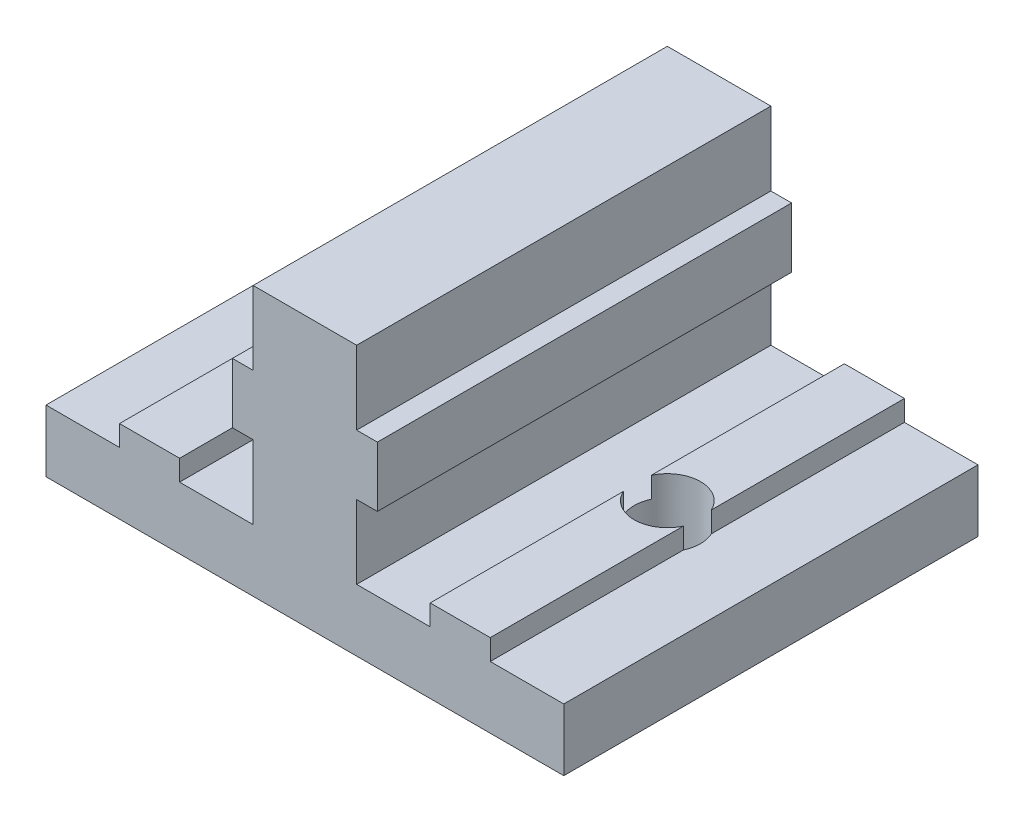
ISO-10303-21;
HEADER;
FILE_DESCRIPTION(('STEP AP214'),'2;1');
FILE_NAME('part.step','',(''),(''),'','','');
FILE_SCHEMA(('AUTOMOTIVE_DESIGN { 1 0 10303 214 1 1 1 1 }'));
ENDSEC;
DATA;
#1=APPLICATION_CONTEXT('core data for automotive mechanical design processes');
#2=APPLICATION_PROTOCOL_DEFINITION('international standard','automotive_design',2000,#1);
#3=PRODUCT_CONTEXT('',#1,'mechanical');
#4=PRODUCT('Part','Part','',(#3));
#5=PRODUCT_RELATED_PRODUCT_CATEGORY('part','',(#4));
#6=PRODUCT_DEFINITION_FORMATION('','',#4);
#7=PRODUCT_DEFINITION_CONTEXT('part definition',#1,'design');
#8=PRODUCT_DEFINITION('design','',#6,#7);
#9=PRODUCT_DEFINITION_SHAPE('','',#8);
#10=(LENGTH_UNIT() NAMED_UNIT(*) SI_UNIT(.MILLI.,.METRE.));
#11=(NAMED_UNIT(*) PLANE_ANGLE_UNIT() SI_UNIT($,.RADIAN.));
#12=(NAMED_UNIT(*) SI_UNIT($,.STERADIAN.) SOLID_ANGLE_UNIT());
#13=UNCERTAINTY_MEASURE_WITH_UNIT(LENGTH_MEASURE(1.E-05),#10,'distance_accuracy_value','');
#14=(GEOMETRIC_REPRESENTATION_CONTEXT(3) GLOBAL_UNCERTAINTY_ASSIGNED_CONTEXT((#13)) GLOBAL_UNIT_ASSIGNED_CONTEXT((#10,
#11,#12)) REPRESENTATION_CONTEXT('',''));
#15=CARTESIAN_POINT('',(0.,0.,0.));
#16=DIRECTION('',(0.,0.,1.));
#17=DIRECTION('',(1.,0.,0.));
#18=AXIS2_PLACEMENT_3D('',#15,#16,#17);
#19=CARTESIAN_POINT('',(8.95,3.,20.));
#20=DIRECTION('',(1.,0.,0.));
#21=DIRECTION('',(0.,0.,-1.));
#22=AXIS2_PLACEMENT_3D('',#19,#20,#21);
#23=PLANE('',#22);
#24=DIRECTION('',(0.,-1.,0.));
#25=VECTOR('',#24,1.);
#26=CARTESIAN_POINT('',(8.95,13.,10.6763874629234));
#27=LINE('',#26,#25);
#28=CARTESIAN_POINT('',(8.95,4.,10.6763874629234));
#29=VERTEX_POINT('',#28);
#30=CARTESIAN_POINT('',(8.95000000000001,3.,10.6763874629234));
#31=VERTEX_POINT('',#30);
#32=EDGE_CURVE('E607',#29,#31,#27,.T.);
#33=ORIENTED_EDGE('',*,*,#32,.F.);
#34=DIRECTION('',(0.,0.,-1.));
#35=VECTOR('',#34,1.);
#36=CARTESIAN_POINT('',(8.95,4.,20.));
#37=LINE('',#36,#35);
#38=CARTESIAN_POINT('',(8.95,4.,20.));
#39=VERTEX_POINT('',#38);
#40=EDGE_CURVE('E267',#39,#29,#37,.T.);
#41=ORIENTED_EDGE('',*,*,#40,.F.);
#42=DIRECTION('',(0.,-1.,0.));
#43=VECTOR('',#42,1.);
#44=CARTESIAN_POINT('',(8.95,3.,20.));
#45=LINE('',#44,#43);
#46=CARTESIAN_POINT('',(8.95,3.,20.));
#47=VERTEX_POINT('',#46);
#48=EDGE_CURVE('E433',#39,#47,#45,.T.);
#49=ORIENTED_EDGE('',*,*,#48,.T.);
#50=DIRECTION('',(0.,0.,-1.));
#51=VECTOR('',#50,1.);
#52=CARTESIAN_POINT('',(8.95,3.,20.));
#53=LINE('',#52,#51);
#54=EDGE_CURVE('E271',#47,#31,#53,.T.);
#55=ORIENTED_EDGE('',*,*,#54,.T.);
#56=EDGE_LOOP('',(#33,#41,#49,#55));
#57=FACE_BOUND('',#56,.T.);
#58=ADVANCED_FACE('F32',(#57),#23,.T.);
#59=CARTESIAN_POINT('',(8.95,4.,20.));
#60=DIRECTION('',(0.,1.,0.));
#61=DIRECTION('',(-1.,0.,0.));
#62=AXIS2_PLACEMENT_3D('',#59,#60,#61);
#63=PLANE('',#62);
#64=CARTESIAN_POINT('',(7.5,4.,10.));
#65=DIRECTION('',(0.,1.,0.));
#66=DIRECTION('',(-1.,0.,0.));
#67=AXIS2_PLACEMENT_3D('',#64,#65,#66);
#68=CIRCLE('',#67,1.6);
#69=CARTESIAN_POINT('',(6.05,4.,10.6763874629234));
#70=VERTEX_POINT('',#69);
#71=EDGE_CURVE('E608',#70,#29,#68,.T.);
#72=ORIENTED_EDGE('',*,*,#71,.F.);
#73=DIRECTION('',(0.,0.,-1.));
#74=VECTOR('',#73,1.);
#75=CARTESIAN_POINT('',(6.05,4.,20.));
#76=LINE('',#75,#74);
#77=CARTESIAN_POINT('',(6.05,4.,20.));
#78=VERTEX_POINT('',#77);
#79=EDGE_CURVE('E251',#78,#70,#76,.T.);
#80=ORIENTED_EDGE('',*,*,#79,.F.);
#81=DIRECTION('',(1.,0.,0.));
#82=VECTOR('',#81,1.);
#83=CARTESIAN_POINT('',(8.95,4.,20.));
#84=LINE('',#83,#82);
#85=EDGE_CURVE('E436',#78,#39,#84,.T.);
#86=ORIENTED_EDGE('',*,*,#85,.T.);
#87=ORIENTED_EDGE('',*,*,#40,.T.);
#88=EDGE_LOOP('',(#72,#80,#86,#87));
#89=FACE_BOUND('',#88,.T.);
#90=ADVANCED_FACE('F577',(#89),#63,.T.);
#91=CARTESIAN_POINT('',(6.05,4.,20.));
#92=DIRECTION('',(-1.,0.,0.));
#93=DIRECTION('',(0.,-1.,0.));
#94=AXIS2_PLACEMENT_3D('',#91,#92,#93);
#95=PLANE('',#94);
#96=DIRECTION('',(0.,-1.,0.));
#97=VECTOR('',#96,1.);
#98=CARTESIAN_POINT('',(6.04999999999999,13.,9.32361253707657));
#99=LINE('',#98,#97);
#100=CARTESIAN_POINT('',(6.05,4.,9.32361253707657));
#101=VERTEX_POINT('',#100);
#102=CARTESIAN_POINT('',(6.05,3.,9.32361253707656));
#103=VERTEX_POINT('',#102);
#104=EDGE_CURVE('E46',#101,#103,#99,.T.);
#105=ORIENTED_EDGE('',*,*,#104,.F.);
#106=CARTESIAN_POINT('',(6.05,4.,0.));
#107=VERTEX_POINT('',#106);
#108=EDGE_CURVE('E258',#101,#107,#76,.T.);
#109=ORIENTED_EDGE('',*,*,#108,.T.);
#110=DIRECTION('',(0.,1.,0.));
#111=VECTOR('',#110,1.);
#112=CARTESIAN_POINT('',(6.05,4.,0.));
#113=LINE('',#112,#111);
#114=CARTESIAN_POINT('',(6.05,3.,0.));
#115=VERTEX_POINT('',#114);
#116=EDGE_CURVE('E469',#115,#107,#113,.T.);
#117=ORIENTED_EDGE('',*,*,#116,.F.);
#118=DIRECTION('',(0.,0.,-1.));
#119=VECTOR('',#118,1.);
#120=CARTESIAN_POINT('',(6.05,3.,20.));
#121=LINE('',#120,#119);
#122=EDGE_CURVE('E259',#103,#115,#121,.T.);
#123=ORIENTED_EDGE('',*,*,#122,.F.);
#124=EDGE_LOOP('',(#105,#109,#117,#123));
#125=FACE_BOUND('',#124,.T.);
#126=ADVANCED_FACE('F584',(#125),#95,.T.);
#127=CARTESIAN_POINT('',(-6.05,4.,20.));
#128=DIRECTION('',(-1.,0.,0.));
#129=DIRECTION('',(0.,-1.,0.));
#130=AXIS2_PLACEMENT_3D('',#127,#128,#129);
#131=PLANE('',#130);
#132=DIRECTION('',(0.,0.,-1.));
#133=VECTOR('',#132,1.);
#134=CARTESIAN_POINT('',(-6.05,4.,20.));
#135=LINE('',#134,#133);
#136=CARTESIAN_POINT('',(-6.05,4.,9.32361253707657));
#137=VERTEX_POINT('',#136);
#138=CARTESIAN_POINT('',(-6.05,4.,0.));
#139=VERTEX_POINT('',#138);
#140=EDGE_CURVE('E349',#137,#139,#135,.T.);
#141=ORIENTED_EDGE('',*,*,#140,.F.);
#142=DIRECTION('',(0.,-1.,0.));
#143=VECTOR('',#142,1.);
#144=CARTESIAN_POINT('',(-6.04999999999999,13.,9.32361253707659));
#145=LINE('',#144,#143);
#146=CARTESIAN_POINT('',(-6.04999999999999,3.,9.32361253707659));
#147=VERTEX_POINT('',#146);
#148=EDGE_CURVE('E419',#137,#147,#145,.T.);
#149=ORIENTED_EDGE('',*,*,#148,.T.);
#150=DIRECTION('',(0.,0.,-1.));
#151=VECTOR('',#150,1.);
#152=CARTESIAN_POINT('',(-6.05,3.,20.));
#153=LINE('',#152,#151);
#154=CARTESIAN_POINT('',(-6.05,3.,0.));
#155=VERTEX_POINT('',#154);
#156=EDGE_CURVE('E353',#147,#155,#153,.T.);
#157=ORIENTED_EDGE('',*,*,#156,.T.);
#158=DIRECTION('',(0.,1.,0.));
#159=VECTOR('',#158,1.);
#160=CARTESIAN_POINT('',(-6.05,4.,0.));
#161=LINE('',#160,#159);
#162=EDGE_CURVE('E324',#155,#139,#161,.T.);
#163=ORIENTED_EDGE('',*,*,#162,.T.);
#164=EDGE_LOOP('',(#141,#149,#157,#163));
#165=FACE_BOUND('',#164,.T.);
#166=ADVANCED_FACE('F564',(#165),#131,.F.);
#167=CARTESIAN_POINT('',(-8.95,4.,20.));
#168=DIRECTION('',(0.,-1.,0.));
#169=DIRECTION('',(1.,0.,0.));
#170=AXIS2_PLACEMENT_3D('',#167,#168,#169);
#171=PLANE('',#170);
#172=CARTESIAN_POINT('',(-6.05,4.,20.));
#173=VERTEX_POINT('',#172);
#174=CARTESIAN_POINT('',(-6.05,4.,10.6763874629234));
#175=VERTEX_POINT('',#174);
#176=EDGE_CURVE('E350',#173,#175,#135,.T.);
#177=ORIENTED_EDGE('',*,*,#176,.T.);
#178=CARTESIAN_POINT('',(-7.5,4.,10.));
#179=DIRECTION('',(0.,-1.,0.));
#180=DIRECTION('',(1.,0.,0.));
#181=AXIS2_PLACEMENT_3D('',#178,#179,#180);
#182=CIRCLE('',#181,1.6);
#183=CARTESIAN_POINT('',(-8.95,4.,10.6763874629234));
#184=VERTEX_POINT('',#183);
#185=EDGE_CURVE('E410',#175,#184,#182,.T.);
#186=ORIENTED_EDGE('',*,*,#185,.T.);
#187=DIRECTION('',(0.,0.,-1.));
#188=VECTOR('',#187,1.);
#189=CARTESIAN_POINT('',(-8.95,4.,20.));
#190=LINE('',#189,#188);
#191=CARTESIAN_POINT('',(-8.95,4.,20.));
#192=VERTEX_POINT('',#191);
#193=EDGE_CURVE('E346',#192,#184,#190,.T.);
#194=ORIENTED_EDGE('',*,*,#193,.F.);
#195=DIRECTION('',(-1.,0.,0.));
#196=VECTOR('',#195,1.);
#197=CARTESIAN_POINT('',(-8.95,4.,20.));
#198=LINE('',#197,#196);
#199=EDGE_CURVE('E299',#173,#192,#198,.T.);
#200=ORIENTED_EDGE('',*,*,#199,.F.);
#201=EDGE_LOOP('',(#177,#186,#194,#200));
#202=FACE_BOUND('',#201,.T.);
#203=ADVANCED_FACE('F559',(#202),#171,.F.);
#204=CARTESIAN_POINT('',(-8.95,3.,20.));
#205=DIRECTION('',(1.,0.,0.));
#206=DIRECTION('',(0.,0.,-1.));
#207=AXIS2_PLACEMENT_3D('',#204,#205,#206);
#208=PLANE('',#207);
#209=ORIENTED_EDGE('',*,*,#193,.T.);
#210=DIRECTION('',(0.,-1.,0.));
#211=VECTOR('',#210,1.);
#212=CARTESIAN_POINT('',(-8.95,13.,10.6763874629234));
#213=LINE('',#212,#211);
#214=CARTESIAN_POINT('',(-8.95,3.,10.6763874629234));
#215=VERTEX_POINT('',#214);
#216=EDGE_CURVE('E405',#184,#215,#213,.T.);
#217=ORIENTED_EDGE('',*,*,#216,.T.);
#218=DIRECTION('',(0.,0.,-1.));
#219=VECTOR('',#218,1.);
#220=CARTESIAN_POINT('',(-8.95,3.,20.));
#221=LINE('',#220,#219);
#222=CARTESIAN_POINT('',(-8.95,3.,20.));
#223=VERTEX_POINT('',#222);
#224=EDGE_CURVE('E342',#223,#215,#221,.T.);
#225=ORIENTED_EDGE('',*,*,#224,.F.);
#226=DIRECTION('',(0.,-1.,0.));
#227=VECTOR('',#226,1.);
#228=CARTESIAN_POINT('',(-8.95,3.,20.));
#229=LINE('',#228,#227);
#230=EDGE_CURVE('E301',#192,#223,#229,.T.);
#231=ORIENTED_EDGE('',*,*,#230,.F.);
#232=EDGE_LOOP('',(#209,#217,#225,#231));
#233=FACE_BOUND('',#232,.T.);
#234=ADVANCED_FACE('F404',(#233),#208,.F.);
#235=CARTESIAN_POINT('',(0.,0.,20.));
#236=DIRECTION('',(0.,1.,0.));
#237=DIRECTION('',(-1.,0.,0.));
#238=AXIS2_PLACEMENT_3D('',#235,#236,#237);
#239=PLANE('',#238);
#240=CARTESIAN_POINT('',(7.5,0.,10.));
#241=DIRECTION('',(0.,-1.,0.));
#242=DIRECTION('',(1.,0.,0.));
#243=AXIS2_PLACEMENT_3D('',#240,#241,#242);
#244=CIRCLE('',#243,1.6);
#245=CARTESIAN_POINT('',(9.1,0.,10.));
#246=VERTEX_POINT('',#245);
#247=EDGE_CURVE('E252',#246,#246,#244,.T.);
#248=ORIENTED_EDGE('',*,*,#247,.F.);
#249=EDGE_LOOP('',(#248));
#250=FACE_BOUND('',#249,.T.);
#251=CARTESIAN_POINT('',(-7.5,0.,10.));
#252=DIRECTION('',(0.,-1.,0.));
#253=DIRECTION('',(1.,0.,0.));
#254=AXIS2_PLACEMENT_3D('',#251,#252,#253);
#255=CIRCLE('',#254,1.6);
#256=CARTESIAN_POINT('',(-5.9,0.,10.));
#257=VERTEX_POINT('',#256);
#258=EDGE_CURVE('E412',#257,#257,#255,.T.);
#259=ORIENTED_EDGE('',*,*,#258,.F.);
#260=EDGE_LOOP('',(#259));
#261=FACE_BOUND('',#260,.T.);
#262=DIRECTION('',(1.,0.,0.));
#263=VECTOR('',#262,1.);
#264=CARTESIAN_POINT('',(0.,0.,0.));
#265=LINE('',#264,#263);
#266=CARTESIAN_POINT('',(-12.5,0.,0.));
#267=VERTEX_POINT('',#266);
#268=CARTESIAN_POINT('',(12.5,0.,0.));
#269=VERTEX_POINT('',#268);
#270=EDGE_CURVE('E279',#267,#269,#265,.T.);
#271=ORIENTED_EDGE('',*,*,#270,.T.);
#272=DIRECTION('',(0.,0.,-1.));
#273=VECTOR('',#272,1.);
#274=CARTESIAN_POINT('',(12.5,0.,20.));
#275=LINE('',#274,#273);
#276=CARTESIAN_POINT('',(12.5,0.,20.));
#277=VERTEX_POINT('',#276);
#278=EDGE_CURVE('E276',#277,#269,#275,.T.);
#279=ORIENTED_EDGE('',*,*,#278,.F.);
#280=DIRECTION('',(1.,0.,0.));
#281=VECTOR('',#280,1.);
#282=CARTESIAN_POINT('',(0.,0.,20.));
#283=LINE('',#282,#281);
#284=CARTESIAN_POINT('',(-12.5,0.,20.));
#285=VERTEX_POINT('',#284);
#286=EDGE_CURVE('E280',#285,#277,#283,.T.);
#287=ORIENTED_EDGE('',*,*,#286,.F.);
#288=DIRECTION('',(0.,0.,-1.));
#289=VECTOR('',#288,1.);
#290=CARTESIAN_POINT('',(-12.5,0.,20.));
#291=LINE('',#290,#289);
#292=EDGE_CURVE('E307',#285,#267,#291,.T.);
#293=ORIENTED_EDGE('',*,*,#292,.T.);
#294=EDGE_LOOP('',(#271,#279,#287,#293));
#295=FACE_BOUND('',#294,.T.);
#296=ADVANCED_FACE('F34',(#250,#261,#295),#239,.F.);
#297=CARTESIAN_POINT('',(-2.5,13.,20.));
#298=DIRECTION('',(0.,-1.,0.));
#299=DIRECTION('',(0.,0.,-1.));
#300=AXIS2_PLACEMENT_3D('',#297,#298,#299);
#301=PLANE('',#300);
#302=DIRECTION('',(-1.,0.,0.));
#303=VECTOR('',#302,1.);
#304=CARTESIAN_POINT('',(-2.5,13.,0.));
#305=LINE('',#304,#303);
#306=CARTESIAN_POINT('',(2.5,13.,0.));
#307=VERTEX_POINT('',#306);
#308=CARTESIAN_POINT('',(-2.5,13.,0.));
#309=VERTEX_POINT('',#308);
#310=EDGE_CURVE('E309',#307,#309,#305,.T.);
#311=ORIENTED_EDGE('',*,*,#310,.T.);
#312=DIRECTION('',(0.,0.,-1.));
#313=VECTOR('',#312,1.);
#314=CARTESIAN_POINT('',(-2.5,13.,20.));
#315=LINE('',#314,#313);
#316=CARTESIAN_POINT('',(-2.5,13.,20.));
#317=VERTEX_POINT('',#316);
#318=EDGE_CURVE('E372',#317,#309,#315,.T.);
#319=ORIENTED_EDGE('',*,*,#318,.F.);
#320=DIRECTION('',(-1.,0.,0.));
#321=VECTOR('',#320,1.);
#322=CARTESIAN_POINT('',(-2.5,13.,20.));
#323=LINE('',#322,#321);
#324=CARTESIAN_POINT('',(2.5,13.,20.));
#325=VERTEX_POINT('',#324);
#326=EDGE_CURVE('E282',#325,#317,#323,.T.);
#327=ORIENTED_EDGE('',*,*,#326,.F.);
#328=DIRECTION('',(0.,0.,-1.));
#329=VECTOR('',#328,1.);
#330=CARTESIAN_POINT('',(2.5,13.,20.));
#331=LINE('',#330,#329);
#332=EDGE_CURVE('E457',#325,#307,#331,.T.);
#333=ORIENTED_EDGE('',*,*,#332,.T.);
#334=EDGE_LOOP('',(#311,#319,#327,#333));
#335=FACE_BOUND('',#334,.T.);
#336=ADVANCED_FACE('F521',(#335),#301,.F.);
#337=CARTESIAN_POINT('',(-2.5,9.45,20.));
#338=DIRECTION('',(1.,0.,0.));
#339=DIRECTION('',(0.,1.,0.));
#340=AXIS2_PLACEMENT_3D('',#337,#338,#339);
#341=PLANE('',#340);
#342=DIRECTION('',(0.,-1.,0.));
#343=VECTOR('',#342,1.);
#344=CARTESIAN_POINT('',(-2.5,9.45,0.));
#345=LINE('',#344,#343);
#346=CARTESIAN_POINT('',(-2.5,9.45,0.));
#347=VERTEX_POINT('',#346);
#348=EDGE_CURVE('E311',#309,#347,#345,.T.);
#349=ORIENTED_EDGE('',*,*,#348,.T.);
#350=DIRECTION('',(0.,0.,-1.));
#351=VECTOR('',#350,1.);
#352=CARTESIAN_POINT('',(-2.5,9.45,20.));
#353=LINE('',#352,#351);
#354=CARTESIAN_POINT('',(-2.5,9.45,20.));
#355=VERTEX_POINT('',#354);
#356=EDGE_CURVE('E369',#355,#347,#353,.T.);
#357=ORIENTED_EDGE('',*,*,#356,.F.);
#358=DIRECTION('',(0.,-1.,0.));
#359=VECTOR('',#358,1.);
#360=CARTESIAN_POINT('',(-2.5,9.45,20.));
#361=LINE('',#360,#359);
#362=EDGE_CURVE('E285',#317,#355,#361,.T.);
#363=ORIENTED_EDGE('',*,*,#362,.F.);
#364=ORIENTED_EDGE('',*,*,#318,.T.);
#365=EDGE_LOOP('',(#349,#357,#363,#364));
#366=FACE_BOUND('',#365,.T.);
#367=ADVANCED_FACE('F528',(#366),#341,.F.);
#368=CARTESIAN_POINT('',(-3.5,9.45,20.));
#369=DIRECTION('',(0.,-1.,0.));
#370=DIRECTION('',(0.,0.,-1.));
#371=AXIS2_PLACEMENT_3D('',#368,#369,#370);
#372=PLANE('',#371);
#373=DIRECTION('',(-1.,0.,0.));
#374=VECTOR('',#373,1.);
#375=CARTESIAN_POINT('',(-3.5,9.45,0.));
#376=LINE('',#375,#374);
#377=CARTESIAN_POINT('',(-3.5,9.45,0.));
#378=VERTEX_POINT('',#377);
#379=EDGE_CURVE('E313',#347,#378,#376,.T.);
#380=ORIENTED_EDGE('',*,*,#379,.T.);
#381=DIRECTION('',(0.,0.,-1.));
#382=VECTOR('',#381,1.);
#383=CARTESIAN_POINT('',(-3.5,9.45,20.));
#384=LINE('',#383,#382);
#385=CARTESIAN_POINT('',(-3.5,9.45,20.));
#386=VERTEX_POINT('',#385);
#387=EDGE_CURVE('E366',#386,#378,#384,.T.);
#388=ORIENTED_EDGE('',*,*,#387,.F.);
#389=DIRECTION('',(-1.,0.,0.));
#390=VECTOR('',#389,1.);
#391=CARTESIAN_POINT('',(-3.5,9.45,20.));
#392=LINE('',#391,#390);
#393=EDGE_CURVE('E287',#355,#386,#392,.T.);
#394=ORIENTED_EDGE('',*,*,#393,.F.);
#395=ORIENTED_EDGE('',*,*,#356,.T.);
#396=EDGE_LOOP('',(#380,#388,#394,#395));
#397=FACE_BOUND('',#396,.T.);
#398=ADVANCED_FACE('F532',(#397),#372,.F.);
#399=CARTESIAN_POINT('',(-3.5,6.55,20.));
#400=DIRECTION('',(1.,0.,0.));
#401=DIRECTION('',(0.,0.,-1.));
#402=AXIS2_PLACEMENT_3D('',#399,#400,#401);
#403=PLANE('',#402);
#404=DIRECTION('',(0.,-1.,0.));
#405=VECTOR('',#404,1.);
#406=CARTESIAN_POINT('',(-3.5,6.55,0.));
#407=LINE('',#406,#405);
#408=CARTESIAN_POINT('',(-3.5,6.55,0.));
#409=VERTEX_POINT('',#408);
#410=EDGE_CURVE('E315',#378,#409,#407,.T.);
#411=ORIENTED_EDGE('',*,*,#410,.T.);
#412=DIRECTION('',(0.,0.,-1.));
#413=VECTOR('',#412,1.);
#414=CARTESIAN_POINT('',(-3.5,6.55,20.));
#415=LINE('',#414,#413);
#416=CARTESIAN_POINT('',(-3.5,6.55,20.));
#417=VERTEX_POINT('',#416);
#418=EDGE_CURVE('E363',#417,#409,#415,.T.);
#419=ORIENTED_EDGE('',*,*,#418,.F.);
#420=DIRECTION('',(0.,-1.,0.));
#421=VECTOR('',#420,1.);
#422=CARTESIAN_POINT('',(-3.5,6.55,20.));
#423=LINE('',#422,#421);
#424=EDGE_CURVE('E289',#386,#417,#423,.T.);
#425=ORIENTED_EDGE('',*,*,#424,.F.);
#426=ORIENTED_EDGE('',*,*,#387,.T.);
#427=EDGE_LOOP('',(#411,#419,#425,#426));
#428=FACE_BOUND('',#427,.T.);
#429=ADVANCED_FACE('F537',(#428),#403,.F.);
#430=CARTESIAN_POINT('',(-2.5,6.55,20.));
#431=DIRECTION('',(0.,1.,0.));
#432=DIRECTION('',(0.,0.,1.));
#433=AXIS2_PLACEMENT_3D('',#430,#431,#432);
#434=PLANE('',#433);
#435=DIRECTION('',(1.,0.,0.));
#436=VECTOR('',#435,1.);
#437=CARTESIAN_POINT('',(-2.5,6.55,0.));
#438=LINE('',#437,#436);
#439=CARTESIAN_POINT('',(-2.5,6.55,0.));
#440=VERTEX_POINT('',#439);
#441=EDGE_CURVE('E317',#409,#440,#438,.T.);
#442=ORIENTED_EDGE('',*,*,#441,.T.);
#443=DIRECTION('',(0.,0.,-1.));
#444=VECTOR('',#443,1.);
#445=CARTESIAN_POINT('',(-2.5,6.55,20.));
#446=LINE('',#445,#444);
#447=CARTESIAN_POINT('',(-2.5,6.55,20.));
#448=VERTEX_POINT('',#447);
#449=EDGE_CURVE('E360',#448,#440,#446,.T.);
#450=ORIENTED_EDGE('',*,*,#449,.F.);
#451=DIRECTION('',(1.,0.,0.));
#452=VECTOR('',#451,1.);
#453=CARTESIAN_POINT('',(-2.5,6.55,20.));
#454=LINE('',#453,#452);
#455=EDGE_CURVE('E291',#417,#448,#454,.T.);
#456=ORIENTED_EDGE('',*,*,#455,.F.);
#457=ORIENTED_EDGE('',*,*,#418,.T.);
#458=EDGE_LOOP('',(#442,#450,#456,#457));
#459=FACE_BOUND('',#458,.T.);
#460=ADVANCED_FACE('F543',(#459),#434,.F.);
#461=CARTESIAN_POINT('',(-2.5,3.,20.));
#462=DIRECTION('',(1.,0.,0.));
#463=DIRECTION('',(0.,1.,0.));
#464=AXIS2_PLACEMENT_3D('',#461,#462,#463);
#465=PLANE('',#464);
#466=DIRECTION('',(0.,-1.,0.));
#467=VECTOR('',#466,1.);
#468=CARTESIAN_POINT('',(-2.5,3.,0.));
#469=LINE('',#468,#467);
#470=CARTESIAN_POINT('',(-2.5,3.,0.));
#471=VERTEX_POINT('',#470);
#472=EDGE_CURVE('E319',#440,#471,#469,.T.);
#473=ORIENTED_EDGE('',*,*,#472,.T.);
#474=DIRECTION('',(0.,0.,-1.));
#475=VECTOR('',#474,1.);
#476=CARTESIAN_POINT('',(-2.5,3.,20.));
#477=LINE('',#476,#475);
#478=CARTESIAN_POINT('',(-2.5,3.,20.));
#479=VERTEX_POINT('',#478);
#480=EDGE_CURVE('E357',#479,#471,#477,.T.);
#481=ORIENTED_EDGE('',*,*,#480,.F.);
#482=DIRECTION('',(0.,-1.,0.));
#483=VECTOR('',#482,1.);
#484=CARTESIAN_POINT('',(-2.5,3.,20.));
#485=LINE('',#484,#483);
#486=EDGE_CURVE('E293',#448,#479,#485,.T.);
#487=ORIENTED_EDGE('',*,*,#486,.F.);
#488=ORIENTED_EDGE('',*,*,#449,.T.);
#489=EDGE_LOOP('',(#473,#481,#487,#488));
#490=FACE_BOUND('',#489,.T.);
#491=ADVANCED_FACE('F547',(#490),#465,.F.);
#492=CARTESIAN_POINT('',(-6.05,3.,20.));
#493=DIRECTION('',(0.,-1.,0.));
#494=DIRECTION('',(1.,0.,0.));
#495=AXIS2_PLACEMENT_3D('',#492,#493,#494);
#496=PLANE('',#495);
#497=ORIENTED_EDGE('',*,*,#156,.F.);
#498=CARTESIAN_POINT('',(-7.5,3.,10.));
#499=DIRECTION('',(0.,-1.,0.));
#500=DIRECTION('',(1.,0.,0.));
#501=AXIS2_PLACEMENT_3D('',#498,#499,#500);
#502=CIRCLE('',#501,1.6);
#503=CARTESIAN_POINT('',(-6.04999999999999,3.,10.6763874629234));
#504=VERTEX_POINT('',#503);
#505=EDGE_CURVE('E422',#147,#504,#502,.T.);
#506=ORIENTED_EDGE('',*,*,#505,.T.);
#507=CARTESIAN_POINT('',(-6.05,3.,20.));
#508=VERTEX_POINT('',#507);
#509=EDGE_CURVE('E354',#508,#504,#153,.T.);
#510=ORIENTED_EDGE('',*,*,#509,.F.);
#511=DIRECTION('',(-1.,0.,0.));
#512=VECTOR('',#511,1.);
#513=CARTESIAN_POINT('',(-6.05,3.,20.));
#514=LINE('',#513,#512);
#515=EDGE_CURVE('E295',#479,#508,#514,.T.);
#516=ORIENTED_EDGE('',*,*,#515,.F.);
#517=ORIENTED_EDGE('',*,*,#480,.T.);
#518=DIRECTION('',(-1.,0.,0.));
#519=VECTOR('',#518,1.);
#520=CARTESIAN_POINT('',(-6.05,3.,0.));
#521=LINE('',#520,#519);
#522=EDGE_CURVE('E321',#471,#155,#521,.T.);
#523=ORIENTED_EDGE('',*,*,#522,.T.);
#524=EDGE_LOOP('',(#497,#506,#510,#516,#517,#523));
#525=FACE_BOUND('',#524,.T.);
#526=ADVANCED_FACE('F553',(#525),#496,.F.);
#527=ORIENTED_EDGE('',*,*,#509,.T.);
#528=DIRECTION('',(0.,-1.,0.));
#529=VECTOR('',#528,1.);
#530=CARTESIAN_POINT('',(-6.04999999999999,13.,10.6763874629234));
#531=LINE('',#530,#529);
#532=EDGE_CURVE('E416',#504,#175,#531,.F.);
#533=ORIENTED_EDGE('',*,*,#532,.T.);
#534=ORIENTED_EDGE('',*,*,#176,.F.);
#535=DIRECTION('',(0.,1.,0.));
#536=VECTOR('',#535,1.);
#537=CARTESIAN_POINT('',(-6.05,4.,20.));
#538=LINE('',#537,#536);
#539=EDGE_CURVE('E297',#508,#173,#538,.T.);
#540=ORIENTED_EDGE('',*,*,#539,.F.);
#541=EDGE_LOOP('',(#527,#533,#534,#540));
#542=FACE_BOUND('',#541,.T.);
#543=ADVANCED_FACE('F557',(#542),#131,.F.);
#544=CARTESIAN_POINT('',(-8.95,4.,9.32361253707655));
#545=VERTEX_POINT('',#544);
#546=CARTESIAN_POINT('',(-8.95,4.,0.));
#547=VERTEX_POINT('',#546);
#548=EDGE_CURVE('E345',#545,#547,#190,.T.);
#549=ORIENTED_EDGE('',*,*,#548,.F.);
#550=EDGE_CURVE('E407',#545,#137,#182,.T.);
#551=ORIENTED_EDGE('',*,*,#550,.T.);
#552=ORIENTED_EDGE('',*,*,#140,.T.);
#553=DIRECTION('',(-1.,0.,0.));
#554=VECTOR('',#553,1.);
#555=CARTESIAN_POINT('',(-8.95,4.,0.));
#556=LINE('',#555,#554);
#557=EDGE_CURVE('E327',#139,#547,#556,.T.);
#558=ORIENTED_EDGE('',*,*,#557,.T.);
#559=EDGE_LOOP('',(#549,#551,#552,#558));
#560=FACE_BOUND('',#559,.T.);
#561=ADVANCED_FACE('F566',(#560),#171,.F.);
#562=CARTESIAN_POINT('',(-8.95,3.,9.32361253707656));
#563=VERTEX_POINT('',#562);
#564=CARTESIAN_POINT('',(-8.95,3.,0.));
#565=VERTEX_POINT('',#564);
#566=EDGE_CURVE('E341',#563,#565,#221,.T.);
#567=ORIENTED_EDGE('',*,*,#566,.F.);
#568=DIRECTION('',(0.,-1.,0.));
#569=VECTOR('',#568,1.);
#570=CARTESIAN_POINT('',(-8.95,13.,9.32361253707655));
#571=LINE('',#570,#569);
#572=EDGE_CURVE('E54',#563,#545,#571,.F.);
#573=ORIENTED_EDGE('',*,*,#572,.T.);
#574=ORIENTED_EDGE('',*,*,#548,.T.);
#575=DIRECTION('',(0.,-1.,0.));
#576=VECTOR('',#575,1.);
#577=CARTESIAN_POINT('',(-8.95,3.,0.));
#578=LINE('',#577,#576);
#579=EDGE_CURVE('E330',#547,#565,#578,.T.);
#580=ORIENTED_EDGE('',*,*,#579,.T.);
#581=EDGE_LOOP('',(#567,#573,#574,#580));
#582=FACE_BOUND('',#581,.T.);
#583=ADVANCED_FACE('F381',(#582),#208,.F.);
#584=CARTESIAN_POINT('',(-12.5,3.,20.));
#585=DIRECTION('',(0.,-1.,0.));
#586=DIRECTION('',(1.,0.,0.));
#587=AXIS2_PLACEMENT_3D('',#584,#585,#586);
#588=PLANE('',#587);
#589=ORIENTED_EDGE('',*,*,#224,.T.);
#590=CARTESIAN_POINT('',(-7.5,3.,10.));
#591=DIRECTION('',(0.,-1.,0.));
#592=DIRECTION('',(1.,0.,0.));
#593=AXIS2_PLACEMENT_3D('',#590,#591,#592);
#594=CIRCLE('',#593,1.6);
#595=EDGE_CURVE('E40',#215,#563,#594,.T.);
#596=ORIENTED_EDGE('',*,*,#595,.T.);
#597=ORIENTED_EDGE('',*,*,#566,.T.);
#598=DIRECTION('',(-1.,0.,0.));
#599=VECTOR('',#598,1.);
#600=CARTESIAN_POINT('',(-12.5,3.,0.));
#601=LINE('',#600,#599);
#602=CARTESIAN_POINT('',(-12.5,3.,0.));
#603=VERTEX_POINT('',#602);
#604=EDGE_CURVE('E333',#565,#603,#601,.T.);
#605=ORIENTED_EDGE('',*,*,#604,.T.);
#606=DIRECTION('',(0.,0.,-1.));
#607=VECTOR('',#606,1.);
#608=CARTESIAN_POINT('',(-12.5,3.,20.));
#609=LINE('',#608,#607);
#610=CARTESIAN_POINT('',(-12.5,3.,20.));
#611=VERTEX_POINT('',#610);
#612=EDGE_CURVE('E338',#611,#603,#609,.T.);
#613=ORIENTED_EDGE('',*,*,#612,.F.);
#614=DIRECTION('',(-1.,0.,0.));
#615=VECTOR('',#614,1.);
#616=CARTESIAN_POINT('',(-12.5,3.,20.));
#617=LINE('',#616,#615);
#618=EDGE_CURVE('E303',#223,#611,#617,.T.);
#619=ORIENTED_EDGE('',*,*,#618,.F.);
#620=EDGE_LOOP('',(#589,#596,#597,#605,#613,#619));
#621=FACE_BOUND('',#620,.T.);
#622=ADVANCED_FACE('F376',(#621),#588,.F.);
#623=CARTESIAN_POINT('',(-12.5,0.,20.));
#624=DIRECTION('',(1.,0.,0.));
#625=DIRECTION('',(0.,1.,0.));
#626=AXIS2_PLACEMENT_3D('',#623,#624,#625);
#627=PLANE('',#626);
#628=DIRECTION('',(0.,-1.,0.));
#629=VECTOR('',#628,1.);
#630=CARTESIAN_POINT('',(-12.5,0.,0.));
#631=LINE('',#630,#629);
#632=EDGE_CURVE('E283',#603,#267,#631,.T.);
#633=ORIENTED_EDGE('',*,*,#632,.T.);
#634=ORIENTED_EDGE('',*,*,#292,.F.);
#635=DIRECTION('',(0.,-1.,0.));
#636=VECTOR('',#635,1.);
#637=CARTESIAN_POINT('',(-12.5,0.,20.));
#638=LINE('',#637,#636);
#639=EDGE_CURVE('E305',#611,#285,#638,.T.);
#640=ORIENTED_EDGE('',*,*,#639,.F.);
#641=ORIENTED_EDGE('',*,*,#612,.T.);
#642=EDGE_LOOP('',(#633,#634,#640,#641));
#643=FACE_BOUND('',#642,.T.);
#644=ADVANCED_FACE('F393',(#643),#627,.F.);
#645=CARTESIAN_POINT('',(0.,0.,20.));
#646=DIRECTION('',(0.,0.,-1.));
#647=DIRECTION('',(-1.,0.,0.));
#648=AXIS2_PLACEMENT_3D('',#645,#646,#647);
#649=PLANE('',#648);
#650=ORIENTED_EDGE('',*,*,#286,.T.);
#651=DIRECTION('',(0.,-1.,0.));
#652=VECTOR('',#651,1.);
#653=CARTESIAN_POINT('',(12.5,0.,20.));
#654=LINE('',#653,#652);
#655=CARTESIAN_POINT('',(12.5,3.,20.));
#656=VERTEX_POINT('',#655);
#657=EDGE_CURVE('E426',#656,#277,#654,.T.);
#658=ORIENTED_EDGE('',*,*,#657,.F.);
#659=DIRECTION('',(1.,0.,0.));
#660=VECTOR('',#659,1.);
#661=CARTESIAN_POINT('',(12.5,3.,20.));
#662=LINE('',#661,#660);
#663=EDGE_CURVE('E429',#47,#656,#662,.T.);
#664=ORIENTED_EDGE('',*,*,#663,.F.);
#665=ORIENTED_EDGE('',*,*,#48,.F.);
#666=ORIENTED_EDGE('',*,*,#85,.F.);
#667=DIRECTION('',(0.,1.,0.));
#668=VECTOR('',#667,1.);
#669=CARTESIAN_POINT('',(6.05,4.,20.));
#670=LINE('',#669,#668);
#671=CARTESIAN_POINT('',(6.05,3.,20.));
#672=VERTEX_POINT('',#671);
#673=EDGE_CURVE('E439',#672,#78,#670,.T.);
#674=ORIENTED_EDGE('',*,*,#673,.F.);
#675=DIRECTION('',(1.,0.,0.));
#676=VECTOR('',#675,1.);
#677=CARTESIAN_POINT('',(6.05,3.,20.));
#678=LINE('',#677,#676);
#679=CARTESIAN_POINT('',(2.5,3.,20.));
#680=VERTEX_POINT('',#679);
#681=EDGE_CURVE('E257',#680,#672,#678,.T.);
#682=ORIENTED_EDGE('',*,*,#681,.F.);
#683=DIRECTION('',(0.,-1.,0.));
#684=VECTOR('',#683,1.);
#685=CARTESIAN_POINT('',(2.5,3.,20.));
#686=LINE('',#685,#684);
#687=CARTESIAN_POINT('',(2.5,6.55,20.));
#688=VERTEX_POINT('',#687);
#689=EDGE_CURVE('E442',#688,#680,#686,.T.);
#690=ORIENTED_EDGE('',*,*,#689,.F.);
#691=DIRECTION('',(-1.,0.,0.));
#692=VECTOR('',#691,1.);
#693=CARTESIAN_POINT('',(2.5,6.55,20.));
#694=LINE('',#693,#692);
#695=CARTESIAN_POINT('',(3.5,6.55,20.));
#696=VERTEX_POINT('',#695);
#697=EDGE_CURVE('E445',#696,#688,#694,.T.);
#698=ORIENTED_EDGE('',*,*,#697,.F.);
#699=DIRECTION('',(0.,-1.,0.));
#700=VECTOR('',#699,1.);
#701=CARTESIAN_POINT('',(3.5,6.55,20.));
#702=LINE('',#701,#700);
#703=CARTESIAN_POINT('',(3.5,9.45,20.));
#704=VERTEX_POINT('',#703);
#705=EDGE_CURVE('E448',#704,#696,#702,.T.);
#706=ORIENTED_EDGE('',*,*,#705,.F.);
#707=DIRECTION('',(1.,0.,0.));
#708=VECTOR('',#707,1.);
#709=CARTESIAN_POINT('',(3.5,9.45,20.));
#710=LINE('',#709,#708);
#711=CARTESIAN_POINT('',(2.5,9.45,20.));
#712=VERTEX_POINT('',#711);
#713=EDGE_CURVE('E451',#712,#704,#710,.T.);
#714=ORIENTED_EDGE('',*,*,#713,.F.);
#715=DIRECTION('',(0.,-1.,0.));
#716=VECTOR('',#715,1.);
#717=CARTESIAN_POINT('',(2.5,9.45,20.));
#718=LINE('',#717,#716);
#719=EDGE_CURVE('E454',#325,#712,#718,.T.);
#720=ORIENTED_EDGE('',*,*,#719,.F.);
#721=ORIENTED_EDGE('',*,*,#326,.T.);
#722=ORIENTED_EDGE('',*,*,#362,.T.);
#723=ORIENTED_EDGE('',*,*,#393,.T.);
#724=ORIENTED_EDGE('',*,*,#424,.T.);
#725=ORIENTED_EDGE('',*,*,#455,.T.);
#726=ORIENTED_EDGE('',*,*,#486,.T.);
#727=ORIENTED_EDGE('',*,*,#515,.T.);
#728=ORIENTED_EDGE('',*,*,#539,.T.);
#729=ORIENTED_EDGE('',*,*,#199,.T.);
#730=ORIENTED_EDGE('',*,*,#230,.T.);
#731=ORIENTED_EDGE('',*,*,#618,.T.);
#732=ORIENTED_EDGE('',*,*,#639,.T.);
#733=EDGE_LOOP('',(#650,#658,#664,#665,#666,#674,#682,#690,#698,#706,#714,#720,#721,#722,#723,
#724,#725,#726,#727,#728,#729,#730,#731,#732));
#734=FACE_BOUND('',#733,.T.);
#735=ADVANCED_FACE('F397',(#734),#649,.F.);
#736=CARTESIAN_POINT('',(0.,0.,0.));
#737=DIRECTION('',(0.,0.,-1.));
#738=DIRECTION('',(-1.,0.,0.));
#739=AXIS2_PLACEMENT_3D('',#736,#737,#738);
#740=PLANE('',#739);
#741=ORIENTED_EDGE('',*,*,#270,.F.);
#742=ORIENTED_EDGE('',*,*,#632,.F.);
#743=ORIENTED_EDGE('',*,*,#604,.F.);
#744=ORIENTED_EDGE('',*,*,#579,.F.);
#745=ORIENTED_EDGE('',*,*,#557,.F.);
#746=ORIENTED_EDGE('',*,*,#162,.F.);
#747=ORIENTED_EDGE('',*,*,#522,.F.);
#748=ORIENTED_EDGE('',*,*,#472,.F.);
#749=ORIENTED_EDGE('',*,*,#441,.F.);
#750=ORIENTED_EDGE('',*,*,#410,.F.);
#751=ORIENTED_EDGE('',*,*,#379,.F.);
#752=ORIENTED_EDGE('',*,*,#348,.F.);
#753=ORIENTED_EDGE('',*,*,#310,.F.);
#754=DIRECTION('',(0.,-1.,0.));
#755=VECTOR('',#754,1.);
#756=CARTESIAN_POINT('',(2.5,9.45,0.));
#757=LINE('',#756,#755);
#758=CARTESIAN_POINT('',(2.5,9.45,0.));
#759=VERTEX_POINT('',#758);
#760=EDGE_CURVE('E430',#307,#759,#757,.T.);
#761=ORIENTED_EDGE('',*,*,#760,.T.);
#762=DIRECTION('',(1.,0.,0.));
#763=VECTOR('',#762,1.);
#764=CARTESIAN_POINT('',(3.5,9.45,0.));
#765=LINE('',#764,#763);
#766=CARTESIAN_POINT('',(3.5,9.45,0.));
#767=VERTEX_POINT('',#766);
#768=EDGE_CURVE('E484',#759,#767,#765,.T.);
#769=ORIENTED_EDGE('',*,*,#768,.T.);
#770=DIRECTION('',(0.,-1.,0.));
#771=VECTOR('',#770,1.);
#772=CARTESIAN_POINT('',(3.5,6.55,0.));
#773=LINE('',#772,#771);
#774=CARTESIAN_POINT('',(3.5,6.55,0.));
#775=VERTEX_POINT('',#774);
#776=EDGE_CURVE('E481',#767,#775,#773,.T.);
#777=ORIENTED_EDGE('',*,*,#776,.T.);
#778=DIRECTION('',(-1.,0.,0.));
#779=VECTOR('',#778,1.);
#780=CARTESIAN_POINT('',(2.5,6.55,0.));
#781=LINE('',#780,#779);
#782=CARTESIAN_POINT('',(2.5,6.55,0.));
#783=VERTEX_POINT('',#782);
#784=EDGE_CURVE('E478',#775,#783,#781,.T.);
#785=ORIENTED_EDGE('',*,*,#784,.T.);
#786=DIRECTION('',(0.,-1.,0.));
#787=VECTOR('',#786,1.);
#788=CARTESIAN_POINT('',(2.5,3.,0.));
#789=LINE('',#788,#787);
#790=CARTESIAN_POINT('',(2.5,3.,0.));
#791=VERTEX_POINT('',#790);
#792=EDGE_CURVE('E475',#783,#791,#789,.T.);
#793=ORIENTED_EDGE('',*,*,#792,.T.);
#794=DIRECTION('',(1.,0.,0.));
#795=VECTOR('',#794,1.);
#796=CARTESIAN_POINT('',(6.05,3.,0.));
#797=LINE('',#796,#795);
#798=EDGE_CURVE('E472',#791,#115,#797,.T.);
#799=ORIENTED_EDGE('',*,*,#798,.T.);
#800=ORIENTED_EDGE('',*,*,#116,.T.);
#801=DIRECTION('',(1.,0.,0.));
#802=VECTOR('',#801,1.);
#803=CARTESIAN_POINT('',(8.95,4.,0.));
#804=LINE('',#803,#802);
#805=CARTESIAN_POINT('',(8.95,4.,0.));
#806=VERTEX_POINT('',#805);
#807=EDGE_CURVE('E466',#107,#806,#804,.T.);
#808=ORIENTED_EDGE('',*,*,#807,.T.);
#809=DIRECTION('',(0.,-1.,0.));
#810=VECTOR('',#809,1.);
#811=CARTESIAN_POINT('',(8.95,3.,0.));
#812=LINE('',#811,#810);
#813=CARTESIAN_POINT('',(8.95,3.,0.));
#814=VERTEX_POINT('',#813);
#815=EDGE_CURVE('E463',#806,#814,#812,.T.);
#816=ORIENTED_EDGE('',*,*,#815,.T.);
#817=DIRECTION('',(1.,0.,0.));
#818=VECTOR('',#817,1.);
#819=CARTESIAN_POINT('',(12.5,3.,0.));
#820=LINE('',#819,#818);
#821=CARTESIAN_POINT('',(12.5,3.,0.));
#822=VERTEX_POINT('',#821);
#823=EDGE_CURVE('E460',#814,#822,#820,.T.);
#824=ORIENTED_EDGE('',*,*,#823,.T.);
#825=DIRECTION('',(0.,-1.,0.));
#826=VECTOR('',#825,1.);
#827=CARTESIAN_POINT('',(12.5,0.,0.));
#828=LINE('',#827,#826);
#829=EDGE_CURVE('E425',#822,#269,#828,.T.);
#830=ORIENTED_EDGE('',*,*,#829,.T.);
#831=EDGE_LOOP('',(#741,#742,#743,#744,#745,#746,#747,#748,#749,#750,#751,#752,#753,#761,#769,
#777,#785,#793,#799,#800,#808,#816,#824,#830));
#832=FACE_BOUND('',#831,.T.);
#833=ADVANCED_FACE('F389',(#832),#740,.T.);
#834=CARTESIAN_POINT('',(12.5,0.,20.));
#835=DIRECTION('',(1.,0.,0.));
#836=DIRECTION('',(0.,1.,0.));
#837=AXIS2_PLACEMENT_3D('',#834,#835,#836);
#838=PLANE('',#837);
#839=ORIENTED_EDGE('',*,*,#829,.F.);
#840=DIRECTION('',(0.,0.,-1.));
#841=VECTOR('',#840,1.);
#842=CARTESIAN_POINT('',(12.5,3.,20.));
#843=LINE('',#842,#841);
#844=EDGE_CURVE('E274',#656,#822,#843,.T.);
#845=ORIENTED_EDGE('',*,*,#844,.F.);
#846=ORIENTED_EDGE('',*,*,#657,.T.);
#847=ORIENTED_EDGE('',*,*,#278,.T.);
#848=EDGE_LOOP('',(#839,#845,#846,#847));
#849=FACE_BOUND('',#848,.T.);
#850=ADVANCED_FACE('F598',(#849),#838,.T.);
#851=CARTESIAN_POINT('',(12.5,3.,20.));
#852=DIRECTION('',(0.,1.,0.));
#853=DIRECTION('',(-1.,0.,0.));
#854=AXIS2_PLACEMENT_3D('',#851,#852,#853);
#855=PLANE('',#854);
#856=CARTESIAN_POINT('',(7.5,3.,10.));
#857=DIRECTION('',(0.,1.,0.));
#858=DIRECTION('',(-1.,0.,0.));
#859=AXIS2_PLACEMENT_3D('',#856,#857,#858);
#860=CIRCLE('',#859,1.6);
#861=CARTESIAN_POINT('',(8.95000000000001,3.,9.32361253707657));
#862=VERTEX_POINT('',#861);
#863=EDGE_CURVE('E611',#31,#862,#860,.T.);
#864=ORIENTED_EDGE('',*,*,#863,.F.);
#865=ORIENTED_EDGE('',*,*,#54,.F.);
#866=ORIENTED_EDGE('',*,*,#663,.T.);
#867=ORIENTED_EDGE('',*,*,#844,.T.);
#868=ORIENTED_EDGE('',*,*,#823,.F.);
#869=EDGE_CURVE('E270',#862,#814,#53,.T.);
#870=ORIENTED_EDGE('',*,*,#869,.F.);
#871=EDGE_LOOP('',(#864,#865,#866,#867,#868,#870));
#872=FACE_BOUND('',#871,.T.);
#873=ADVANCED_FACE('F591',(#872),#855,.T.);
#874=DIRECTION('',(0.,-1.,0.));
#875=VECTOR('',#874,1.);
#876=CARTESIAN_POINT('',(8.95,13.,9.32361253707657));
#877=LINE('',#876,#875);
#878=CARTESIAN_POINT('',(8.95,4.,9.32361253707657));
#879=VERTEX_POINT('',#878);
#880=EDGE_CURVE('E602',#862,#879,#877,.F.);
#881=ORIENTED_EDGE('',*,*,#880,.F.);
#882=ORIENTED_EDGE('',*,*,#869,.T.);
#883=ORIENTED_EDGE('',*,*,#815,.F.);
#884=EDGE_CURVE('E266',#879,#806,#37,.T.);
#885=ORIENTED_EDGE('',*,*,#884,.F.);
#886=EDGE_LOOP('',(#881,#882,#883,#885));
#887=FACE_BOUND('',#886,.T.);
#888=ADVANCED_FACE('F580',(#887),#23,.T.);
#889=EDGE_CURVE('E615',#879,#101,#68,.T.);
#890=ORIENTED_EDGE('',*,*,#889,.F.);
#891=ORIENTED_EDGE('',*,*,#884,.T.);
#892=ORIENTED_EDGE('',*,*,#807,.F.);
#893=ORIENTED_EDGE('',*,*,#108,.F.);
#894=EDGE_LOOP('',(#890,#891,#892,#893));
#895=FACE_BOUND('',#894,.T.);
#896=ADVANCED_FACE('F587',(#895),#63,.T.);
#897=DIRECTION('',(0.,-1.,0.));
#898=VECTOR('',#897,1.);
#899=CARTESIAN_POINT('',(6.04999999999999,13.,10.6763874629234));
#900=LINE('',#899,#898);
#901=CARTESIAN_POINT('',(6.05,3.,10.6763874629234));
#902=VERTEX_POINT('',#901);
#903=EDGE_CURVE('E240',#902,#70,#900,.F.);
#904=ORIENTED_EDGE('',*,*,#903,.F.);
#905=EDGE_CURVE('E249',#672,#902,#121,.T.);
#906=ORIENTED_EDGE('',*,*,#905,.F.);
#907=ORIENTED_EDGE('',*,*,#673,.T.);
#908=ORIENTED_EDGE('',*,*,#79,.T.);
#909=EDGE_LOOP('',(#904,#906,#907,#908));
#910=FACE_BOUND('',#909,.T.);
#911=ADVANCED_FACE('F247',(#910),#95,.T.);
#912=CARTESIAN_POINT('',(6.05,3.,20.));
#913=DIRECTION('',(0.,1.,0.));
#914=DIRECTION('',(-1.,0.,0.));
#915=AXIS2_PLACEMENT_3D('',#912,#913,#914);
#916=PLANE('',#915);
#917=CARTESIAN_POINT('',(7.5,3.,10.));
#918=DIRECTION('',(0.,1.,0.));
#919=DIRECTION('',(-1.,0.,0.));
#920=AXIS2_PLACEMENT_3D('',#917,#918,#919);
#921=CIRCLE('',#920,1.6);
#922=EDGE_CURVE('E11',#103,#902,#921,.T.);
#923=ORIENTED_EDGE('',*,*,#922,.F.);
#924=ORIENTED_EDGE('',*,*,#122,.T.);
#925=ORIENTED_EDGE('',*,*,#798,.F.);
#926=DIRECTION('',(0.,0.,-1.));
#927=VECTOR('',#926,1.);
#928=CARTESIAN_POINT('',(2.5,3.,20.));
#929=LINE('',#928,#927);
#930=EDGE_CURVE('E262',#680,#791,#929,.T.);
#931=ORIENTED_EDGE('',*,*,#930,.F.);
#932=ORIENTED_EDGE('',*,*,#681,.T.);
#933=ORIENTED_EDGE('',*,*,#905,.T.);
#934=EDGE_LOOP('',(#923,#924,#925,#931,#932,#933));
#935=FACE_BOUND('',#934,.T.);
#936=ADVANCED_FACE('F255',(#935),#916,.T.);
#937=CARTESIAN_POINT('',(2.5,3.,20.));
#938=DIRECTION('',(1.,0.,0.));
#939=DIRECTION('',(0.,1.,0.));
#940=AXIS2_PLACEMENT_3D('',#937,#938,#939);
#941=PLANE('',#940);
#942=ORIENTED_EDGE('',*,*,#792,.F.);
#943=DIRECTION('',(0.,0.,-1.));
#944=VECTOR('',#943,1.);
#945=CARTESIAN_POINT('',(2.5,6.55,20.));
#946=LINE('',#945,#944);
#947=EDGE_CURVE('E496',#688,#783,#946,.T.);
#948=ORIENTED_EDGE('',*,*,#947,.F.);
#949=ORIENTED_EDGE('',*,*,#689,.T.);
#950=ORIENTED_EDGE('',*,*,#930,.T.);
#951=EDGE_LOOP('',(#942,#948,#949,#950));
#952=FACE_BOUND('',#951,.T.);
#953=ADVANCED_FACE('F502',(#952),#941,.T.);
#954=CARTESIAN_POINT('',(2.5,6.55,20.));
#955=DIRECTION('',(0.,-1.,0.));
#956=DIRECTION('',(0.,0.,-1.));
#957=AXIS2_PLACEMENT_3D('',#954,#955,#956);
#958=PLANE('',#957);
#959=ORIENTED_EDGE('',*,*,#784,.F.);
#960=DIRECTION('',(0.,0.,-1.));
#961=VECTOR('',#960,1.);
#962=CARTESIAN_POINT('',(3.5,6.55,20.));
#963=LINE('',#962,#961);
#964=EDGE_CURVE('E495',#696,#775,#963,.T.);
#965=ORIENTED_EDGE('',*,*,#964,.F.);
#966=ORIENTED_EDGE('',*,*,#697,.T.);
#967=ORIENTED_EDGE('',*,*,#947,.T.);
#968=EDGE_LOOP('',(#959,#965,#966,#967));
#969=FACE_BOUND('',#968,.T.);
#970=ADVANCED_FACE('F506',(#969),#958,.T.);
#971=CARTESIAN_POINT('',(3.5,6.55,20.));
#972=DIRECTION('',(1.,0.,0.));
#973=DIRECTION('',(0.,0.,-1.));
#974=AXIS2_PLACEMENT_3D('',#971,#972,#973);
#975=PLANE('',#974);
#976=ORIENTED_EDGE('',*,*,#776,.F.);
#977=DIRECTION('',(0.,0.,-1.));
#978=VECTOR('',#977,1.);
#979=CARTESIAN_POINT('',(3.5,9.45,20.));
#980=LINE('',#979,#978);
#981=EDGE_CURVE('E493',#704,#767,#980,.T.);
#982=ORIENTED_EDGE('',*,*,#981,.F.);
#983=ORIENTED_EDGE('',*,*,#705,.T.);
#984=ORIENTED_EDGE('',*,*,#964,.T.);
#985=EDGE_LOOP('',(#976,#982,#983,#984));
#986=FACE_BOUND('',#985,.T.);
#987=ADVANCED_FACE('F511',(#986),#975,.T.);
#988=CARTESIAN_POINT('',(3.5,9.45,20.));
#989=DIRECTION('',(0.,1.,0.));
#990=DIRECTION('',(0.,0.,1.));
#991=AXIS2_PLACEMENT_3D('',#988,#989,#990);
#992=PLANE('',#991);
#993=ORIENTED_EDGE('',*,*,#768,.F.);
#994=DIRECTION('',(0.,0.,-1.));
#995=VECTOR('',#994,1.);
#996=CARTESIAN_POINT('',(2.5,9.45,20.));
#997=LINE('',#996,#995);
#998=EDGE_CURVE('E491',#712,#759,#997,.T.);
#999=ORIENTED_EDGE('',*,*,#998,.F.);
#1000=ORIENTED_EDGE('',*,*,#713,.T.);
#1001=ORIENTED_EDGE('',*,*,#981,.T.);
#1002=EDGE_LOOP('',(#993,#999,#1000,#1001));
#1003=FACE_BOUND('',#1002,.T.);
#1004=ADVANCED_FACE('F514',(#1003),#992,.T.);
#1005=CARTESIAN_POINT('',(2.5,9.45,20.));
#1006=DIRECTION('',(1.,0.,0.));
#1007=DIRECTION('',(0.,1.,0.));
#1008=AXIS2_PLACEMENT_3D('',#1005,#1006,#1007);
#1009=PLANE('',#1008);
#1010=ORIENTED_EDGE('',*,*,#760,.F.);
#1011=ORIENTED_EDGE('',*,*,#332,.F.);
#1012=ORIENTED_EDGE('',*,*,#719,.T.);
#1013=ORIENTED_EDGE('',*,*,#998,.T.);
#1014=EDGE_LOOP('',(#1010,#1011,#1012,#1013));
#1015=FACE_BOUND('',#1014,.T.);
#1016=ADVANCED_FACE('F519',(#1015),#1009,.T.);
#1017=CARTESIAN_POINT('',(-7.50000000000001,13.,10.));
#1018=DIRECTION('',(0.,-1.,0.));
#1019=DIRECTION('',(1.,0.,0.));
#1020=AXIS2_PLACEMENT_3D('',#1017,#1018,#1019);
#1021=CYLINDRICAL_SURFACE('',#1020,1.6);
#1022=ORIENTED_EDGE('',*,*,#258,.T.);
#1023=EDGE_LOOP('',(#1022));
#1024=FACE_BOUND('',#1023,.T.);
#1025=ORIENTED_EDGE('',*,*,#148,.F.);
#1026=ORIENTED_EDGE('',*,*,#550,.F.);
#1027=ORIENTED_EDGE('',*,*,#572,.F.);
#1028=ORIENTED_EDGE('',*,*,#595,.F.);
#1029=ORIENTED_EDGE('',*,*,#216,.F.);
#1030=ORIENTED_EDGE('',*,*,#185,.F.);
#1031=ORIENTED_EDGE('',*,*,#532,.F.);
#1032=ORIENTED_EDGE('',*,*,#505,.F.);
#1033=EDGE_LOOP('',(#1025,#1026,#1027,#1028,#1029,#1030,#1031,#1032));
#1034=FACE_BOUND('',#1033,.T.);
#1035=ADVANCED_FACE('F560',(#1024,#1034),#1021,.F.);
#1036=CARTESIAN_POINT('',(7.5,13.,10.));
#1037=DIRECTION('',(0.,-1.,0.));
#1038=DIRECTION('',(1.,0.,0.));
#1039=AXIS2_PLACEMENT_3D('',#1036,#1037,#1038);
#1040=CYLINDRICAL_SURFACE('',#1039,1.6);
#1041=ORIENTED_EDGE('',*,*,#863,.T.);
#1042=ORIENTED_EDGE('',*,*,#880,.T.);
#1043=ORIENTED_EDGE('',*,*,#889,.T.);
#1044=ORIENTED_EDGE('',*,*,#104,.T.);
#1045=ORIENTED_EDGE('',*,*,#922,.T.);
#1046=ORIENTED_EDGE('',*,*,#903,.T.);
#1047=ORIENTED_EDGE('',*,*,#71,.T.);
#1048=ORIENTED_EDGE('',*,*,#32,.T.);
#1049=EDGE_LOOP('',(#1041,#1042,#1043,#1044,#1045,#1046,#1047,#1048));
#1050=FACE_BOUND('',#1049,.T.);
#1051=ORIENTED_EDGE('',*,*,#247,.T.);
#1052=EDGE_LOOP('',(#1051));
#1053=FACE_BOUND('',#1052,.T.);
#1054=ADVANCED_FACE('F238',(#1050,#1053),#1040,.F.);
#1055=CLOSED_SHELL('',(#58,#90,#126,#166,#203,#234,#296,#336,#367,#398,#429,#460,#491,#526,#543,
#561,#583,#622,#644,#735,#833,#850,#873,#888,#896,#911,#936,#953,#970,#987,#1004,#1016,#1035,#1054));
#1056=MANIFOLD_SOLID_BREP('B2',#1055);
#1057=ADVANCED_BREP_SHAPE_REPRESENTATION('',(#18,#1056),#14);
#1058=SHAPE_DEFINITION_REPRESENTATION(#9,#1057);
ENDSEC;
END-ISO-10303-21;
